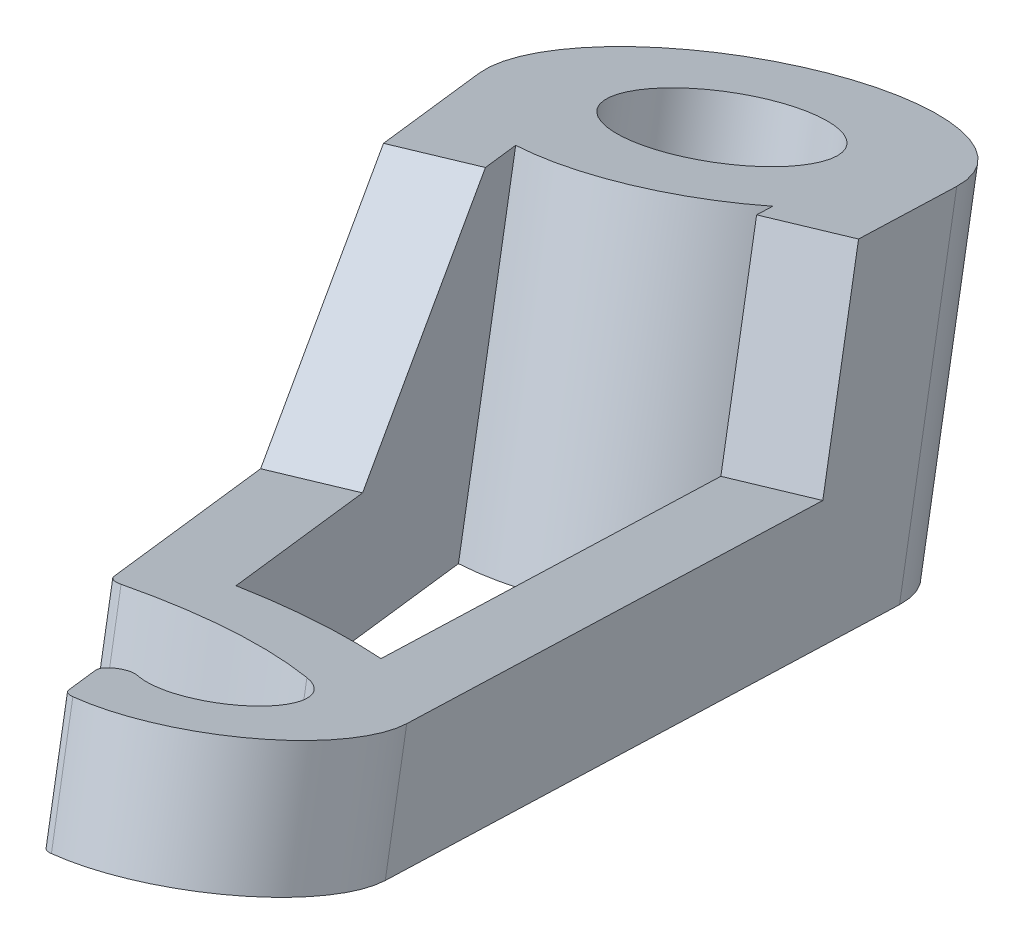
ISO-10303-21;
HEADER;
FILE_DESCRIPTION(('STEP AP214'),'2;1');
FILE_NAME('part.step','',(''),(''),'','','');
FILE_SCHEMA(('AUTOMOTIVE_DESIGN { 1 0 10303 214 1 1 1 1 }'));
ENDSEC;
DATA;
#1=APPLICATION_CONTEXT('core data for automotive mechanical design processes');
#2=APPLICATION_PROTOCOL_DEFINITION('international standard','automotive_design',2000,#1);
#3=PRODUCT_CONTEXT('',#1,'mechanical');
#4=PRODUCT('Part','Part','',(#3));
#5=PRODUCT_RELATED_PRODUCT_CATEGORY('part','',(#4));
#6=PRODUCT_DEFINITION_FORMATION('','',#4);
#7=PRODUCT_DEFINITION_CONTEXT('part definition',#1,'design');
#8=PRODUCT_DEFINITION('design','',#6,#7);
#9=PRODUCT_DEFINITION_SHAPE('','',#8);
#10=(LENGTH_UNIT() NAMED_UNIT(*) SI_UNIT(.MILLI.,.METRE.));
#11=(NAMED_UNIT(*) PLANE_ANGLE_UNIT() SI_UNIT($,.RADIAN.));
#12=(NAMED_UNIT(*) SI_UNIT($,.STERADIAN.) SOLID_ANGLE_UNIT());
#13=UNCERTAINTY_MEASURE_WITH_UNIT(LENGTH_MEASURE(1.E-05),#10,'distance_accuracy_value','');
#14=(GEOMETRIC_REPRESENTATION_CONTEXT(3) GLOBAL_UNCERTAINTY_ASSIGNED_CONTEXT((#13)) GLOBAL_UNIT_ASSIGNED_CONTEXT((#10,
#11,#12)) REPRESENTATION_CONTEXT('',''));
#15=CARTESIAN_POINT('',(0.,0.,0.));
#16=DIRECTION('',(0.,0.,1.));
#17=DIRECTION('',(1.,0.,0.));
#18=AXIS2_PLACEMENT_3D('',#15,#16,#17);
#19=CARTESIAN_POINT('',(-6.2463706120076,4.28236772923862,0.0966297651229249));
#20=DIRECTION('',(0.131884115621641,-0.93969262078591,0.31556989477326));
#21=DIRECTION('',(0.,-0.318350642704083,-0.947973031414869));
#22=AXIS2_PLACEMENT_3D('',#19,#20,#21);
#23=CYLINDRICAL_SURFACE('',#22,2.8300926820941);
#24=CARTESIAN_POINT('',(-6.08151546748055,3.10775195325624,0.4910921335895));
#25=DIRECTION('',(-0.131884115621641,0.93969262078591,-0.31556989477326));
#26=DIRECTION('',(0.,0.318350642704083,0.947973031414869));
#27=AXIS2_PLACEMENT_3D('',#24,#25,#26);
#28=CIRCLE('',#27,2.8300926820941);
#29=CARTESIAN_POINT('',(-4.92935117989364,2.43159707758848,-2.00385408381932));
#30=VERTEX_POINT('',#29);
#31=CARTESIAN_POINT('',(-6.29427963284796,2.1825502912952,-2.17502074546919));
#32=VERTEX_POINT('',#31);
#33=EDGE_CURVE('E197',#30,#32,#28,.T.);
#34=ORIENTED_EDGE('',*,*,#33,.T.);
#35=DIRECTION('',(0.131884115621641,-0.93969262078591,0.31556989477326));
#36=VECTOR('',#35,1.);
#37=CARTESIAN_POINT('',(-6.45913477737501,3.35716606727759,-2.56948311393577));
#38=LINE('',#37,#36);
#39=CARTESIAN_POINT('',(-6.19536654613173,1.47778082570577,-1.93834332438925));
#40=VERTEX_POINT('',#39);
#41=EDGE_CURVE('E285',#32,#40,#38,.T.);
#42=ORIENTED_EDGE('',*,*,#41,.T.);
#43=CARTESIAN_POINT('',(-5.98260238076432,2.4029824876668,0.727769554669445));
#44=DIRECTION('',(-0.131884115621641,0.93969262078591,-0.31556989477326));
#45=DIRECTION('',(0.,0.318350642704083,0.947973031414869));
#46=AXIS2_PLACEMENT_3D('',#43,#44,#45);
#47=CIRCLE('',#46,2.8300926820941);
#48=CARTESIAN_POINT('',(-4.83043809317741,1.72682761199905,-1.76717666273938));
#49=VERTEX_POINT('',#48);
#50=EDGE_CURVE('E256',#49,#40,#47,.T.);
#51=ORIENTED_EDGE('',*,*,#50,.F.);
#52=DIRECTION('',(0.131884115621641,-0.93969262078591,0.31556989477326));
#53=VECTOR('',#52,1.);
#54=CARTESIAN_POINT('',(-5.09420632442069,3.60621285357087,-2.3983164522859));
#55=LINE('',#54,#53);
#56=EDGE_CURVE('E264',#30,#49,#55,.T.);
#57=ORIENTED_EDGE('',*,*,#56,.F.);
#58=EDGE_LOOP('',(#34,#42,#51,#57));
#59=FACE_BOUND('',#58,.T.);
#60=ADVANCED_FACE('F37',(#59),#23,.F.);
#61=CARTESIAN_POINT('',(-5.26376823124328,3.7057213275453,-2.03113978954651));
#62=DIRECTION('',(0.131884115621641,-0.93969262078591,0.31556989477326));
#63=DIRECTION('',(0.,-0.318350642704083,-0.947973031414869));
#64=AXIS2_PLACEMENT_3D('',#61,#62,#63);
#65=CYLINDRICAL_SURFACE('',#64,0.416499553779431);
#66=DIRECTION('',(0.131884115621641,-0.93969262078591,0.31556989477326));
#67=VECTOR('',#66,1.);
#68=CARTESIAN_POINT('',(-5.43333013806587,3.80522980151974,-1.66396312680713));
#69=LINE('',#68,#67);
#70=CARTESIAN_POINT('',(-5.26847499353882,2.63061402553736,-1.26950075834056));
#71=VERTEX_POINT('',#70);
#72=CARTESIAN_POINT('',(-5.16956190682259,1.92584455994792,-1.03282333726061));
#73=VERTEX_POINT('',#72);
#74=EDGE_CURVE('E266',#71,#73,#69,.T.);
#75=ORIENTED_EDGE('',*,*,#74,.F.);
#76=CARTESIAN_POINT('',(-5.09891308671623,2.53110555156292,-1.63667742107994));
#77=DIRECTION('',(-0.131884115621641,0.93969262078591,-0.31556989477326));
#78=DIRECTION('',(0.,0.318350642704083,0.947973031414869));
#79=AXIS2_PLACEMENT_3D('',#76,#77,#78);
#80=CIRCLE('',#79,0.416499553779431);
#81=EDGE_CURVE('E352',#71,#30,#80,.T.);
#82=ORIENTED_EDGE('',*,*,#81,.T.);
#83=ORIENTED_EDGE('',*,*,#56,.T.);
#84=CARTESIAN_POINT('',(-5.,1.82633608597348,-1.39999999999999));
#85=DIRECTION('',(-0.131884115621641,0.93969262078591,-0.31556989477326));
#86=DIRECTION('',(0.,-0.318350642704083,-0.947973031414869));
#87=AXIS2_PLACEMENT_3D('',#84,#85,#86);
#88=CIRCLE('',#87,0.416499553779431);
#89=EDGE_CURVE('E253',#73,#49,#88,.T.);
#90=ORIENTED_EDGE('',*,*,#89,.F.);
#91=EDGE_LOOP('',(#75,#82,#83,#90));
#92=FACE_BOUND('',#91,.T.);
#93=ADVANCED_FACE('F367',(#92),#65,.F.);
#94=CARTESIAN_POINT('',(-5.43333013806587,3.80522980151974,-1.66396312680713));
#95=DIRECTION('',(0.407111857105102,-0.238916159864932,-0.881577565708106));
#96=DIRECTION('',(-0.907869279140984,0.,-0.419253350603224));
#97=AXIS2_PLACEMENT_3D('',#94,#95,#96);
#98=PLANE('',#97);
#99=DIRECTION('',(0.90380668057452,0.244738323512896,0.351050761504607));
#100=VECTOR('',#99,1.);
#101=CARTESIAN_POINT('',(-5.16956190682259,1.92584455994792,-1.03282333726061));
#102=LINE('',#101,#100);
#103=CARTESIAN_POINT('',(-5.20408425009461,1.9164963878247,-1.04623228317243));
#104=VERTEX_POINT('',#103);
#105=EDGE_CURVE('E251',#104,#73,#102,.T.);
#106=ORIENTED_EDGE('',*,*,#105,.F.);
#107=DIRECTION('',(0.131884115621641,-0.93969262078591,0.31556989477326));
#108=VECTOR('',#107,1.);
#109=CARTESIAN_POINT('',(-5.4678524813379,3.79588162939652,-1.67737207271895));
#110=LINE('',#109,#108);
#111=CARTESIAN_POINT('',(-5.30299733681085,2.62126585341413,-1.28290970425238));
#112=VERTEX_POINT('',#111);
#113=EDGE_CURVE('E12',#104,#112,#110,.F.);
#114=ORIENTED_EDGE('',*,*,#113,.T.);
#115=DIRECTION('',(0.90380668057452,0.244738323512896,0.351050761504607));
#116=VECTOR('',#115,1.);
#117=CARTESIAN_POINT('',(-5.26847499353882,2.63061402553736,-1.26950075834056));
#118=LINE('',#117,#116);
#119=EDGE_CURVE('E312',#112,#71,#118,.T.);
#120=ORIENTED_EDGE('',*,*,#119,.T.);
#121=ORIENTED_EDGE('',*,*,#74,.T.);
#122=EDGE_LOOP('',(#106,#114,#120,#121));
#123=FACE_BOUND('',#122,.T.);
#124=ADVANCED_FACE('F371',(#123),#98,.T.);
#125=CARTESIAN_POINT('',(-5.42002594293278,3.97343360751462,-1.16865205353568));
#126=DIRECTION('',(-0.905981049360744,0.0149187091184674,0.423055280450965));
#127=DIRECTION('',(0.42310236756999,0.,0.906081887335063));
#128=AXIS2_PLACEMENT_3D('',#125,#126,#127);
#129=PLANE('',#128);
#130=DIRECTION('',(-0.402249820690952,-0.341694615934679,-0.84937616589786));
#131=VECTOR('',#130,1.);
#132=CARTESIAN_POINT('',(-5.1562577116895,2.0940483659428,-0.537512263989163));
#133=LINE('',#132,#131);
#134=CARTESIAN_POINT('',(-5.17852533271077,2.07513294119613,-0.584531766780298));
#135=VERTEX_POINT('',#134);
#136=CARTESIAN_POINT('',(-5.3353935407412,1.94187987472304,-0.915768998556527));
#137=VERTEX_POINT('',#136);
#138=EDGE_CURVE('E248',#135,#137,#133,.T.);
#139=ORIENTED_EDGE('',*,*,#138,.F.);
#140=DIRECTION('',(0.131884115621641,-0.93969262078591,0.31556989477326));
#141=VECTOR('',#140,1.);
#142=CARTESIAN_POINT('',(-5.44229356395405,3.95451818276795,-1.21567155632682));
#143=LINE('',#142,#141);
#144=CARTESIAN_POINT('',(-5.277438419427,2.77990240678556,-0.821209187860243));
#145=VERTEX_POINT('',#144);
#146=EDGE_CURVE('E45',#135,#145,#143,.F.);
#147=ORIENTED_EDGE('',*,*,#146,.T.);
#148=DIRECTION('',(-0.402249820690952,-0.341694615934678,-0.84937616589786));
#149=VECTOR('',#148,1.);
#150=CARTESIAN_POINT('',(-5.25517079840573,2.79881783153223,-0.774189685069108));
#151=LINE('',#150,#149);
#152=CARTESIAN_POINT('',(-5.43430662745743,2.64664934031247,-1.15244641963647));
#153=VERTEX_POINT('',#152);
#154=EDGE_CURVE('E309',#145,#153,#151,.T.);
#155=ORIENTED_EDGE('',*,*,#154,.T.);
#156=DIRECTION('',(0.131884115621641,-0.93969262078591,0.31556989477326));
#157=VECTOR('',#156,1.);
#158=CARTESIAN_POINT('',(-5.59916177198448,3.82126511629486,-1.54690878810305));
#159=LINE('',#158,#157);
#160=EDGE_CURVE('E303',#153,#137,#159,.T.);
#161=ORIENTED_EDGE('',*,*,#160,.T.);
#162=EDGE_LOOP('',(#139,#147,#155,#161));
#163=FACE_BOUND('',#162,.T.);
#164=ADVANCED_FACE('F308',(#163),#129,.T.);
#165=CARTESIAN_POINT('',(-5.26376823124328,3.7057213275453,-2.03113978954651));
#166=DIRECTION('',(0.131884115621641,-0.93969262078591,0.31556989477326));
#167=DIRECTION('',(0.,-0.318350642704083,-0.947973031414869));
#168=AXIS2_PLACEMENT_3D('',#165,#166,#167);
#169=CYLINDRICAL_SURFACE('',#168,0.91649955377943);
#170=CARTESIAN_POINT('',(-5.09891308671623,2.53110555156292,-1.63667742107994));
#171=DIRECTION('',(-0.131884115621641,0.93969262078591,-0.31556989477326));
#172=DIRECTION('',(0.,0.318350642704083,0.947973031414869));
#173=AXIS2_PLACEMENT_3D('',#170,#171,#172);
#174=CIRCLE('',#173,0.91649955377943);
#175=CARTESIAN_POINT('',(-4.23961052888823,2.54477854181296,-1.9550853285285));
#176=VERTEX_POINT('',#175);
#177=CARTESIAN_POINT('',(-5.19760911740915,2.80869897671438,-0.768822354887411));
#178=VERTEX_POINT('',#177);
#179=EDGE_CURVE('E172',#176,#178,#174,.F.);
#180=ORIENTED_EDGE('',*,*,#179,.T.);
#181=DIRECTION('',(0.131884115621641,-0.93969262078591,0.31556989477326));
#182=VECTOR('',#181,1.);
#183=CARTESIAN_POINT('',(-5.3624642619362,3.98331475269677,-1.16328472335399));
#184=LINE('',#183,#182);
#185=CARTESIAN_POINT('',(-5.09869603069292,2.10392951112495,-0.532144933807466));
#186=VERTEX_POINT('',#185);
#187=EDGE_CURVE('E300',#178,#186,#184,.T.);
#188=ORIENTED_EDGE('',*,*,#187,.T.);
#189=CARTESIAN_POINT('',(-5.,1.82633608597348,-1.39999999999999));
#190=DIRECTION('',(0.131884115621641,-0.93969262078591,0.31556989477326));
#191=DIRECTION('',(0.,0.318350642704083,0.947973031414869));
#192=AXIS2_PLACEMENT_3D('',#189,#190,#191);
#193=CIRCLE('',#192,0.91649955377943);
#194=CARTESIAN_POINT('',(-4.140697442172,1.84000907622353,-1.71840790744856));
#195=VERTEX_POINT('',#194);
#196=EDGE_CURVE('E245',#195,#186,#193,.T.);
#197=ORIENTED_EDGE('',*,*,#196,.F.);
#198=DIRECTION('',(0.131884115621641,-0.93969262078591,0.31556989477326));
#199=VECTOR('',#198,1.);
#200=CARTESIAN_POINT('',(-4.40446567341528,3.71939431779535,-2.34954769699508));
#201=LINE('',#200,#199);
#202=EDGE_CURVE('E269',#176,#195,#201,.T.);
#203=ORIENTED_EDGE('',*,*,#202,.F.);
#204=EDGE_LOOP('',(#180,#188,#197,#203));
#205=FACE_BOUND('',#204,.T.);
#206=ADVANCED_FACE('F318',(#205),#169,.T.);
#207=CARTESIAN_POINT('',(-6.2463706120076,4.28236772923862,0.0966297651229249));
#208=DIRECTION('',(0.131884115621641,-0.93969262078591,0.31556989477326));
#209=DIRECTION('',(0.,-0.318350642704083,-0.947973031414869));
#210=AXIS2_PLACEMENT_3D('',#207,#208,#209);
#211=CYLINDRICAL_SURFACE('',#210,3.3300926820941);
#212=CARTESIAN_POINT('',(-6.08151546748055,3.10775195325624,0.4910921335895));
#213=DIRECTION('',(-0.131884115621641,0.93969262078591,-0.31556989477326));
#214=DIRECTION('',(0.,0.318350642704083,0.947973031414869));
#215=AXIS2_PLACEMENT_3D('',#212,#213,#214);
#216=CIRCLE('',#215,3.3300926820941);
#217=CARTESIAN_POINT('',(-4.9819336993829,2.24684352112363,-2.53203106570073));
#218=VERTEX_POINT('',#217);
#219=CARTESIAN_POINT('',(-6.04764977837671,2.05194188459175,-2.6670141795901));
#220=VERTEX_POINT('',#219);
#221=EDGE_CURVE('E185',#218,#220,#216,.T.);
#222=ORIENTED_EDGE('',*,*,#221,.F.);
#223=DIRECTION('',(0.131884115621641,-0.93969262078591,0.31556989477326));
#224=VECTOR('',#223,1.);
#225=CARTESIAN_POINT('',(-5.14678884390995,3.42145929710601,-2.92649343416731));
#226=LINE('',#225,#224);
#227=CARTESIAN_POINT('',(-4.88302061266667,1.54207405553419,-2.29535364462079));
#228=VERTEX_POINT('',#227);
#229=EDGE_CURVE('E222',#218,#228,#226,.T.);
#230=ORIENTED_EDGE('',*,*,#229,.T.);
#231=CARTESIAN_POINT('',(-5.98260238076432,2.4029824876668,0.727769554669445));
#232=DIRECTION('',(-0.131884115621641,0.93969262078591,-0.31556989477326));
#233=DIRECTION('',(0.,0.318350642704083,0.947973031414869));
#234=AXIS2_PLACEMENT_3D('',#231,#232,#233);
#235=CIRCLE('',#234,3.3300926820941);
#236=CARTESIAN_POINT('',(-5.94873669166048,1.34717241900232,-2.43033675851016));
#237=VERTEX_POINT('',#236);
#238=EDGE_CURVE('E212',#228,#237,#235,.T.);
#239=ORIENTED_EDGE('',*,*,#238,.T.);
#240=DIRECTION('',(0.131884115621641,-0.93969262078591,0.31556989477326));
#241=VECTOR('',#240,1.);
#242=CARTESIAN_POINT('',(-6.21250492290376,3.22655766057414,-3.06147654805668));
#243=LINE('',#242,#241);
#244=EDGE_CURVE('E220',#220,#237,#243,.T.);
#245=ORIENTED_EDGE('',*,*,#244,.F.);
#246=EDGE_LOOP('',(#222,#230,#239,#245));
#247=FACE_BOUND('',#246,.T.);
#248=ADVANCED_FACE('F404',(#247),#211,.T.);
#249=CARTESIAN_POINT('',(-7.39794712077145,1.69127416274271,-7.13776392256838));
#250=DIRECTION('',(0.131884115621641,-0.93969262078591,0.31556989477326));
#251=DIRECTION('',(0.,-0.318350642704083,-0.947973031414869));
#252=AXIS2_PLACEMENT_3D('',#249,#250,#251);
#253=CYLINDRICAL_SURFACE('',#252,1.17341117996063);
#254=CARTESIAN_POINT('',(-7.13417888952816,-0.188111078829114,-6.50662413302186));
#255=DIRECTION('',(0.131884115621641,-0.93969262078591,0.31556989477326));
#256=DIRECTION('',(0.,0.318350642704083,0.947973031414869));
#257=AXIS2_PLACEMENT_3D('',#254,#255,#256);
#258=CIRCLE('',#257,1.17341117996063);
#259=CARTESIAN_POINT('',(-8.19726718168052,-0.170605298758924,-6.01020633719932));
#260=VERTEX_POINT('',#259);
#261=CARTESIAN_POINT('',(-6.03399807201866,-0.170605298758921,-6.9142876139775));
#262=VERTEX_POINT('',#261);
#263=EDGE_CURVE('E229',#260,#262,#258,.T.);
#264=ORIENTED_EDGE('',*,*,#263,.F.);
#265=DIRECTION('',(0.131884115621641,-0.93969262078591,0.31556989477326));
#266=VECTOR('',#265,1.);
#267=CARTESIAN_POINT('',(-8.4610354129238,1.7087799428129,-6.64134612674584));
#268=LINE('',#267,#266);
#269=CARTESIAN_POINT('',(-8.4610354129238,1.7087799428129,-6.64134612674584));
#270=VERTEX_POINT('',#269);
#271=EDGE_CURVE('E260',#270,#260,#268,.T.);
#272=ORIENTED_EDGE('',*,*,#271,.F.);
#273=CARTESIAN_POINT('',(-7.39794712077145,1.69127416274271,-7.13776392256838));
#274=DIRECTION('',(0.131884115621641,-0.93969262078591,0.31556989477326));
#275=DIRECTION('',(0.,0.318350642704083,0.947973031414869));
#276=AXIS2_PLACEMENT_3D('',#273,#274,#275);
#277=CIRCLE('',#276,1.17341117996063);
#278=CARTESIAN_POINT('',(-6.29776630326194,1.7087799428129,-7.54542740352402));
#279=VERTEX_POINT('',#278);
#280=EDGE_CURVE('E232',#270,#279,#277,.T.);
#281=ORIENTED_EDGE('',*,*,#280,.T.);
#282=DIRECTION('',(0.131884115621641,-0.93969262078591,0.31556989477326));
#283=VECTOR('',#282,1.);
#284=CARTESIAN_POINT('',(-6.29776630326194,1.7087799428129,-7.54542740352402));
#285=LINE('',#284,#283);
#286=EDGE_CURVE('E239',#279,#262,#285,.T.);
#287=ORIENTED_EDGE('',*,*,#286,.T.);
#288=EDGE_LOOP('',(#264,#272,#281,#287));
#289=FACE_BOUND('',#288,.T.);
#290=ADVANCED_FACE('F329',(#289),#253,.T.);
#291=CARTESIAN_POINT('',(-8.4610354129238,1.7087799428129,-6.64134612674584));
#292=DIRECTION('',(-0.905981049360744,0.0149187091184675,0.423055280450965));
#293=DIRECTION('',(0.42310236756999,0.,0.906081887335063));
#294=AXIS2_PLACEMENT_3D('',#291,#292,#293);
#295=PLANE('',#294);
#296=DIRECTION('',(-0.402249820690953,-0.341694615934678,-0.84937616589786));
#297=VECTOR('',#296,1.);
#298=CARTESIAN_POINT('',(-8.19726718168052,-0.170605298758924,-6.01020633719932));
#299=LINE('',#298,#297);
#300=CARTESIAN_POINT('',(-6.29348257324447,1.44658112902993,-1.99024364677185));
#301=VERTEX_POINT('',#300);
#302=EDGE_CURVE('E235',#301,#260,#299,.T.);
#303=ORIENTED_EDGE('',*,*,#302,.F.);
#304=DIRECTION('',(0.131884115621641,-0.93969262078591,0.31556989477326));
#305=VECTOR('',#304,1.);
#306=CARTESIAN_POINT('',(-6.55725080448775,3.32596637060175,-2.62138343631837));
#307=LINE('',#306,#305);
#308=CARTESIAN_POINT('',(-6.3923956599607,2.15135059461936,-2.22692106785179));
#309=VERTEX_POINT('',#308);
#310=EDGE_CURVE('E294',#301,#309,#307,.F.);
#311=ORIENTED_EDGE('',*,*,#310,.T.);
#312=DIRECTION('',(-0.402249820690953,-0.341694615934678,-0.84937616589786));
#313=VECTOR('',#312,1.);
#314=CARTESIAN_POINT('',(-8.29618026839676,0.534164166830509,-6.24688375827926));
#315=LINE('',#314,#313);
#316=CARTESIAN_POINT('',(-7.24038476161121,1.43101886169889,-4.01750417027771));
#317=VERTEX_POINT('',#316);
#318=EDGE_CURVE('E193',#309,#317,#315,.T.);
#319=ORIENTED_EDGE('',*,*,#318,.T.);
#320=DIRECTION('',(-0.377780708199163,0.422416998636175,-0.823920879560498));
#321=VECTOR('',#320,1.);
#322=CARTESIAN_POINT('',(-8.00407379504532,2.28494078622588,-5.68307185671981));
#323=LINE('',#322,#321);
#324=CARTESIAN_POINT('',(-7.9085312037971,2.1781094585242,-5.47469823120576));
#325=VERTEX_POINT('',#324);
#326=EDGE_CURVE('E282',#317,#325,#323,.T.);
#327=ORIENTED_EDGE('',*,*,#326,.T.);
#328=DIRECTION('',(-0.402249820690953,-0.341694615934678,-0.84937616589786));
#329=VECTOR('',#328,1.);
#330=CARTESIAN_POINT('',(-8.4610354129238,1.7087799428129,-6.64134612674584));
#331=LINE('',#330,#329);
#332=EDGE_CURVE('E237',#325,#270,#331,.T.);
#333=ORIENTED_EDGE('',*,*,#332,.T.);
#334=ORIENTED_EDGE('',*,*,#271,.T.);
#335=EDGE_LOOP('',(#303,#311,#319,#327,#333,#334));
#336=FACE_BOUND('',#335,.T.);
#337=ADVANCED_FACE('F332',(#336),#295,.T.);
#338=CARTESIAN_POINT('',(-4.40446567341528,3.71939431779535,-2.34954769699508));
#339=DIRECTION('',(0.937591899837199,0.0149187091184697,-0.347417416773988));
#340=DIRECTION('',(-0.347456085208141,0.,-0.937696256178851));
#341=AXIS2_PLACEMENT_3D('',#338,#339,#340);
#342=PLANE('',#341);
#343=DIRECTION('',(-0.131884115621641,0.93969262078591,-0.315569894773261));
#344=VECTOR('',#343,1.);
#345=CARTESIAN_POINT('',(-5.93633691205236,2.09260442269277,-6.55353863027565));
#346=LINE('',#345,#344);
#347=CARTESIAN_POINT('',(-5.77148176752531,0.917988646710389,-6.15907626180908));
#348=VERTEX_POINT('',#347);
#349=CARTESIAN_POINT('',(-5.93633691205236,2.09260442269278,-6.55353863027565));
#350=VERTEX_POINT('',#349);
#351=EDGE_CURVE('E180',#348,#350,#346,.T.);
#352=ORIENTED_EDGE('',*,*,#351,.F.);
#353=DIRECTION('',(0.321757687408351,0.341694615934678,0.883015730343963));
#354=VECTOR('',#353,1.);
#355=CARTESIAN_POINT('',(-4.23961052888823,2.54477854181296,-1.9550853285285));
#356=LINE('',#355,#354);
#357=EDGE_CURVE('E166',#348,#176,#356,.T.);
#358=ORIENTED_EDGE('',*,*,#357,.T.);
#359=ORIENTED_EDGE('',*,*,#202,.T.);
#360=DIRECTION('',(0.321757687408351,0.341694615934678,0.883015730343963));
#361=VECTOR('',#360,1.);
#362=CARTESIAN_POINT('',(-4.140697442172,1.84000907622353,-1.71840790744856));
#363=LINE('',#362,#361);
#364=EDGE_CURVE('E242',#262,#195,#363,.T.);
#365=ORIENTED_EDGE('',*,*,#364,.F.);
#366=ORIENTED_EDGE('',*,*,#286,.F.);
#367=DIRECTION('',(0.321757687408351,0.341694615934678,0.883015730343963));
#368=VECTOR('',#367,1.);
#369=CARTESIAN_POINT('',(-4.40446567341528,3.71939431779535,-2.34954769699508));
#370=LINE('',#369,#368);
#371=EDGE_CURVE('E191',#279,#350,#370,.T.);
#372=ORIENTED_EDGE('',*,*,#371,.T.);
#373=EDGE_LOOP('',(#352,#358,#359,#365,#366,#372));
#374=FACE_BOUND('',#373,.T.);
#375=ADVANCED_FACE('F189',(#374),#342,.T.);
#376=CARTESIAN_POINT('',(-7.39794712077145,1.69127416274271,-7.13776392256838));
#377=DIRECTION('',(-0.131884115621641,0.93969262078591,-0.31556989477326));
#378=DIRECTION('',(0.,0.318350642704083,0.947973031414869));
#379=AXIS2_PLACEMENT_3D('',#376,#377,#378);
#380=PLANE('',#379);
#381=DIRECTION('',(-0.922664646897069,0.,0.385603357566174));
#382=VECTOR('',#381,1.);
#383=CARTESIAN_POINT('',(-4.9947527034833,2.09260442269278,-6.94704891971456));
#384=LINE('',#383,#382);
#385=CARTESIAN_POINT('',(-6.39810873996081,2.09260442269278,-6.36055327219372));
#386=VERTEX_POINT('',#385);
#387=EDGE_CURVE('E186',#350,#386,#384,.T.);
#388=ORIENTED_EDGE('',*,*,#387,.F.);
#389=ORIENTED_EDGE('',*,*,#371,.F.);
#390=ORIENTED_EDGE('',*,*,#280,.F.);
#391=ORIENTED_EDGE('',*,*,#332,.F.);
#392=DIRECTION('',(0.922664646897069,0.,-0.385603357566174));
#393=VECTOR('',#392,1.);
#394=CARTESIAN_POINT('',(-4.90416554606949,2.1781094585242,-6.73029362967724));
#395=LINE('',#394,#393);
#396=CARTESIAN_POINT('',(-7.44675937588866,2.1781094585242,-5.66768358928769));
#397=VERTEX_POINT('',#396);
#398=EDGE_CURVE('E277',#325,#397,#395,.T.);
#399=ORIENTED_EDGE('',*,*,#398,.T.);
#400=DIRECTION('',(-0.402249820690954,-0.341694615934678,-0.84937616589786));
#401=VECTOR('',#400,1.);
#402=CARTESIAN_POINT('',(-6.21250492290376,3.22655766057414,-3.06147654805669));
#403=LINE('',#402,#401);
#404=CARTESIAN_POINT('',(-7.62150579516114,2.02966958969665,-6.03667180499675));
#405=VERTEX_POINT('',#404);
#406=EDGE_CURVE('E207',#397,#405,#403,.T.);
#407=ORIENTED_EDGE('',*,*,#406,.T.);
#408=CARTESIAN_POINT('',(-7.39794712077145,1.69127416274271,-7.13776392256838));
#409=DIRECTION('',(-0.131884115621641,0.93969262078591,-0.31556989477326));
#410=DIRECTION('',(0.,0.318350642704083,0.947973031414869));
#411=AXIS2_PLACEMENT_3D('',#408,#409,#410);
#412=CIRCLE('',#411,1.17341117996063);
#413=CARTESIAN_POINT('',(-6.45737150085294,2.02966958969665,-6.52319103389839));
#414=VERTEX_POINT('',#413);
#415=EDGE_CURVE('E201',#405,#414,#412,.T.);
#416=ORIENTED_EDGE('',*,*,#415,.T.);
#417=DIRECTION('',(0.321757687408351,0.341694615934678,0.883015730343963));
#418=VECTOR('',#417,1.);
#419=CARTESIAN_POINT('',(-6.45737150085294,2.02966958969665,-6.52319103389839));
#420=LINE('',#419,#418);
#421=EDGE_CURVE('E203',#414,#386,#420,.T.);
#422=ORIENTED_EDGE('',*,*,#421,.T.);
#423=EDGE_LOOP('',(#388,#389,#390,#391,#399,#407,#416,#422));
#424=FACE_BOUND('',#423,.T.);
#425=CARTESIAN_POINT('',(-7.39794712077145,1.69127416274271,-7.13776392256838));
#426=DIRECTION('',(0.131884115621641,-0.93969262078591,0.31556989477326));
#427=DIRECTION('',(0.,-0.318350642704083,-0.947973031414869));
#428=AXIS2_PLACEMENT_3D('',#425,#426,#427);
#429=CIRCLE('',#428,0.573411179960617);
#430=CARTESIAN_POINT('',(-7.39794712077145,1.50872834506854,-7.68134225708283));
#431=VERTEX_POINT('',#430);
#432=EDGE_CURVE('E226',#431,#431,#429,.T.);
#433=ORIENTED_EDGE('',*,*,#432,.T.);
#434=EDGE_LOOP('',(#433));
#435=FACE_BOUND('',#434,.T.);
#436=ADVANCED_FACE('F326',(#424,#435),#380,.T.);
#437=CARTESIAN_POINT('',(-7.13417888952816,-0.188111078829114,-6.50662413302186));
#438=DIRECTION('',(-0.131884115621641,0.93969262078591,-0.31556989477326));
#439=DIRECTION('',(0.,0.318350642704083,0.947973031414869));
#440=AXIS2_PLACEMENT_3D('',#437,#438,#439);
#441=PLANE('',#440);
#442=DIRECTION('',(0.321757687408351,0.341694615934678,0.883015730343963));
#443=VECTOR('',#442,1.);
#444=CARTESIAN_POINT('',(-6.19360326960966,0.150284348124828,-5.89205124435187));
#445=LINE('',#444,#443);
#446=CARTESIAN_POINT('',(-6.19360326960966,0.150284348124828,-5.89205124435187));
#447=VERTEX_POINT('',#446);
#448=EDGE_CURVE('E195',#447,#228,#445,.T.);
#449=ORIENTED_EDGE('',*,*,#448,.F.);
#450=CARTESIAN_POINT('',(-7.13417888952816,-0.188111078829114,-6.50662413302186));
#451=DIRECTION('',(-0.131884115621641,0.93969262078591,-0.31556989477326));
#452=DIRECTION('',(0.,0.318350642704083,0.947973031414869));
#453=AXIS2_PLACEMENT_3D('',#450,#451,#452);
#454=CIRCLE('',#453,1.17341117996063);
#455=CARTESIAN_POINT('',(-7.35773756391786,0.150284348124826,-5.40553201545023));
#456=VERTEX_POINT('',#455);
#457=EDGE_CURVE('E192',#456,#447,#454,.T.);
#458=ORIENTED_EDGE('',*,*,#457,.F.);
#459=DIRECTION('',(-0.402249820690954,-0.341694615934678,-0.84937616589786));
#460=VECTOR('',#459,1.);
#461=CARTESIAN_POINT('',(-5.94873669166048,1.34717241900232,-2.43033675851017));
#462=LINE('',#461,#460);
#463=EDGE_CURVE('E204',#237,#456,#462,.T.);
#464=ORIENTED_EDGE('',*,*,#463,.F.);
#465=ORIENTED_EDGE('',*,*,#238,.F.);
#466=EDGE_LOOP('',(#449,#458,#464,#465));
#467=FACE_BOUND('',#466,.T.);
#468=CARTESIAN_POINT('',(-7.13417888952816,-0.188111078829114,-6.50662413302186));
#469=DIRECTION('',(0.131884115621641,-0.93969262078591,0.31556989477326));
#470=DIRECTION('',(0.,-0.318350642704083,-0.947973031414869));
#471=AXIS2_PLACEMENT_3D('',#468,#469,#470);
#472=CIRCLE('',#471,0.573411179960617);
#473=CARTESIAN_POINT('',(-7.13417888952816,-0.370656896503283,-7.05020246753631));
#474=VERTEX_POINT('',#473);
#475=EDGE_CURVE('E219',#474,#474,#472,.T.);
#476=ORIENTED_EDGE('',*,*,#475,.F.);
#477=EDGE_LOOP('',(#476));
#478=FACE_BOUND('',#477,.T.);
#479=ORIENTED_EDGE('',*,*,#50,.T.);
#480=CARTESIAN_POINT('',(-6.2028844683084,1.44508925811808,-2.03254917481694));
#481=DIRECTION('',(-0.131884115621641,0.93969262078591,-0.31556989477326));
#482=DIRECTION('',(0.,0.318350642704083,0.947973031414869));
#483=AXIS2_PLACEMENT_3D('',#480,#481,#482);
#484=CIRCLE('',#483,0.1);
#485=EDGE_CURVE('E292',#40,#301,#484,.F.);
#486=ORIENTED_EDGE('',*,*,#485,.T.);
#487=ORIENTED_EDGE('',*,*,#302,.T.);
#488=ORIENTED_EDGE('',*,*,#263,.T.);
#489=ORIENTED_EDGE('',*,*,#364,.T.);
#490=ORIENTED_EDGE('',*,*,#196,.T.);
#491=CARTESIAN_POINT('',(-5.08792722777469,2.07364107028428,-0.626837294825394));
#492=DIRECTION('',(-0.131884115621641,0.93969262078591,-0.31556989477326));
#493=DIRECTION('',(0.,0.318350642704083,0.947973031414869));
#494=AXIS2_PLACEMENT_3D('',#491,#492,#493);
#495=CIRCLE('',#494,0.1);
#496=EDGE_CURVE('E290',#186,#135,#495,.F.);
#497=ORIENTED_EDGE('',*,*,#496,.T.);
#498=ORIENTED_EDGE('',*,*,#138,.T.);
#499=CARTESIAN_POINT('',(-5.24479543580512,1.94038800381119,-0.958074526601623));
#500=DIRECTION('',(-0.131884115621641,0.93969262078591,-0.31556989477326));
#501=DIRECTION('',(0.,0.318350642704083,0.947973031414869));
#502=AXIS2_PLACEMENT_3D('',#499,#500,#501);
#503=CIRCLE('',#502,0.1);
#504=EDGE_CURVE('E288',#137,#104,#503,.F.);
#505=ORIENTED_EDGE('',*,*,#504,.T.);
#506=ORIENTED_EDGE('',*,*,#105,.T.);
#507=ORIENTED_EDGE('',*,*,#89,.T.);
#508=EDGE_LOOP('',(#479,#486,#487,#488,#489,#490,#497,#498,#505,#506,#507));
#509=FACE_BOUND('',#508,.T.);
#510=ADVANCED_FACE('F320',(#467,#478,#509),#441,.F.);
#511=CARTESIAN_POINT('',(-7.39794712077145,1.69127416274271,-7.13776392256838));
#512=DIRECTION('',(0.131884115621641,-0.93969262078591,0.31556989477326));
#513=DIRECTION('',(0.,-0.318350642704083,-0.947973031414869));
#514=AXIS2_PLACEMENT_3D('',#511,#512,#513);
#515=CYLINDRICAL_SURFACE('',#514,0.573411179960617);
#516=ORIENTED_EDGE('',*,*,#432,.F.);
#517=EDGE_LOOP('',(#516));
#518=FACE_BOUND('',#517,.T.);
#519=ORIENTED_EDGE('',*,*,#475,.T.);
#520=EDGE_LOOP('',(#519));
#521=FACE_BOUND('',#520,.T.);
#522=ADVANCED_FACE('F389',(#518,#521),#515,.F.);
#523=CARTESIAN_POINT('',(-7.39794712077145,1.69127416274271,-7.13776392256838));
#524=DIRECTION('',(0.131884115621641,-0.93969262078591,0.31556989477326));
#525=DIRECTION('',(0.,-0.318350642704083,-0.947973031414869));
#526=AXIS2_PLACEMENT_3D('',#523,#524,#525);
#527=CYLINDRICAL_SURFACE('',#526,1.17341117996063);
#528=ORIENTED_EDGE('',*,*,#457,.T.);
#529=DIRECTION('',(0.131884115621641,-0.93969262078591,0.31556989477326));
#530=VECTOR('',#529,1.);
#531=CARTESIAN_POINT('',(-6.45737150085294,2.02966958969665,-6.52319103389839));
#532=LINE('',#531,#530);
#533=EDGE_CURVE('E208',#414,#447,#532,.T.);
#534=ORIENTED_EDGE('',*,*,#533,.F.);
#535=ORIENTED_EDGE('',*,*,#415,.F.);
#536=DIRECTION('',(0.131884115621641,-0.93969262078591,0.31556989477326));
#537=VECTOR('',#536,1.);
#538=CARTESIAN_POINT('',(-7.62150579516114,2.02966958969665,-6.03667180499675));
#539=LINE('',#538,#537);
#540=EDGE_CURVE('E217',#405,#456,#539,.T.);
#541=ORIENTED_EDGE('',*,*,#540,.T.);
#542=EDGE_LOOP('',(#528,#534,#535,#541));
#543=FACE_BOUND('',#542,.T.);
#544=ADVANCED_FACE('F395',(#543),#527,.T.);
#545=CARTESIAN_POINT('',(-6.21250492290376,3.22655766057414,-3.06147654805669));
#546=DIRECTION('',(-0.905981049360743,0.0149187091184678,0.423055280450966));
#547=DIRECTION('',(0.423102367569991,0.,0.906081887335062));
#548=AXIS2_PLACEMENT_3D('',#545,#546,#547);
#549=PLANE('',#548);
#550=ORIENTED_EDGE('',*,*,#406,.F.);
#551=DIRECTION('',(0.377780708199164,-0.422416998636175,0.823920879560498));
#552=VECTOR('',#551,1.);
#553=CARTESIAN_POINT('',(-6.62670944152886,1.26116736887828,-3.87919558940535));
#554=LINE('',#553,#552);
#555=CARTESIAN_POINT('',(-6.77861293370277,1.43101886169889,-4.21048952835964));
#556=VERTEX_POINT('',#555);
#557=EDGE_CURVE('E280',#397,#556,#554,.T.);
#558=ORIENTED_EDGE('',*,*,#557,.T.);
#559=DIRECTION('',(-0.402249820690954,-0.341694615934678,-0.84937616589786));
#560=VECTOR('',#559,1.);
#561=CARTESIAN_POINT('',(-6.04764977837671,2.05194188459175,-2.66701417959011));
#562=LINE('',#561,#560);
#563=EDGE_CURVE('E176',#220,#556,#562,.T.);
#564=ORIENTED_EDGE('',*,*,#563,.F.);
#565=ORIENTED_EDGE('',*,*,#244,.T.);
#566=ORIENTED_EDGE('',*,*,#463,.T.);
#567=ORIENTED_EDGE('',*,*,#540,.F.);
#568=EDGE_LOOP('',(#550,#558,#564,#565,#566,#567));
#569=FACE_BOUND('',#568,.T.);
#570=ADVANCED_FACE('F344',(#569),#549,.F.);
#571=CARTESIAN_POINT('',(-6.45737150085294,2.02966958969665,-6.52319103389839));
#572=DIRECTION('',(0.937591899837199,0.0149187091184699,-0.347417416773988));
#573=DIRECTION('',(-0.34745608520814,0.,-0.937696256178851));
#574=AXIS2_PLACEMENT_3D('',#571,#572,#573);
#575=PLANE('',#574);
#576=DIRECTION('',(0.321757687408351,0.341694615934678,0.883015730343963));
#577=VECTOR('',#576,1.);
#578=CARTESIAN_POINT('',(-6.29251635632589,0.85505381371426,-6.12872866543182));
#579=LINE('',#578,#577);
#580=CARTESIAN_POINT('',(-6.23325359543375,0.91798864671039,-5.96609090372715));
#581=VERTEX_POINT('',#580);
#582=EDGE_CURVE('E263',#581,#218,#579,.T.);
#583=ORIENTED_EDGE('',*,*,#582,.F.);
#584=DIRECTION('',(-0.131884115621641,0.93969262078591,-0.315569894773261));
#585=VECTOR('',#584,1.);
#586=CARTESIAN_POINT('',(-6.39810873996081,2.09260442269278,-6.36055327219372));
#587=LINE('',#586,#585);
#588=EDGE_CURVE('E183',#581,#386,#587,.T.);
#589=ORIENTED_EDGE('',*,*,#588,.T.);
#590=ORIENTED_EDGE('',*,*,#421,.F.);
#591=ORIENTED_EDGE('',*,*,#533,.T.);
#592=ORIENTED_EDGE('',*,*,#448,.T.);
#593=ORIENTED_EDGE('',*,*,#229,.F.);
#594=EDGE_LOOP('',(#583,#589,#590,#591,#592,#593));
#595=FACE_BOUND('',#594,.T.);
#596=ADVANCED_FACE('F400',(#595),#575,.F.);
#597=CARTESIAN_POINT('',(-3.47717558382932,-8.72034309635163,-3.31581820097186));
#598=DIRECTION('',(-0.362348629655204,-0.342020143325666,-0.867021160149213));
#599=DIRECTION('',(-0.922664646897069,0.,0.385603357566174));
#600=AXIS2_PLACEMENT_3D('',#597,#598,#599);
#601=PLANE('',#600);
#602=ORIENTED_EDGE('',*,*,#351,.T.);
#603=ORIENTED_EDGE('',*,*,#387,.T.);
#604=ORIENTED_EDGE('',*,*,#588,.F.);
#605=DIRECTION('',(0.922664646897069,0.,-0.385603357566174));
#606=VECTOR('',#605,1.);
#607=CARTESIAN_POINT('',(-4.82989755895625,0.91798864671039,-6.55258655124799));
#608=LINE('',#607,#606);
#609=EDGE_CURVE('E170',#581,#348,#608,.T.);
#610=ORIENTED_EDGE('',*,*,#609,.T.);
#611=EDGE_LOOP('',(#602,#603,#604,#610));
#612=FACE_BOUND('',#611,.T.);
#613=ADVANCED_FACE('F179',(#612),#601,.F.);
#614=CARTESIAN_POINT('',(-7.23309197624439,0.516658386760318,-6.74330155410181));
#615=DIRECTION('',(-0.131884115621641,0.93969262078591,-0.31556989477326));
#616=DIRECTION('',(0.,0.318350642704083,0.947973031414869));
#617=AXIS2_PLACEMENT_3D('',#614,#615,#616);
#618=PLANE('',#617);
#619=ORIENTED_EDGE('',*,*,#318,.F.);
#620=CARTESIAN_POINT('',(-6.30179755502463,2.14985872370751,-2.26922659589689));
#621=DIRECTION('',(-0.131884115621641,0.93969262078591,-0.31556989477326));
#622=DIRECTION('',(0.,0.318350642704083,0.947973031414869));
#623=AXIS2_PLACEMENT_3D('',#620,#621,#622);
#624=CIRCLE('',#623,0.1);
#625=EDGE_CURVE('E298',#309,#32,#624,.T.);
#626=ORIENTED_EDGE('',*,*,#625,.T.);
#627=ORIENTED_EDGE('',*,*,#33,.F.);
#628=ORIENTED_EDGE('',*,*,#81,.F.);
#629=ORIENTED_EDGE('',*,*,#119,.F.);
#630=CARTESIAN_POINT('',(-5.34370852252136,2.64515746940062,-1.19475194768157));
#631=DIRECTION('',(-0.131884115621641,0.93969262078591,-0.31556989477326));
#632=DIRECTION('',(0.,0.318350642704083,0.947973031414869));
#633=AXIS2_PLACEMENT_3D('',#630,#631,#632);
#634=CIRCLE('',#633,0.1);
#635=EDGE_CURVE('E58',#112,#153,#634,.T.);
#636=ORIENTED_EDGE('',*,*,#635,.T.);
#637=ORIENTED_EDGE('',*,*,#154,.F.);
#638=CARTESIAN_POINT('',(-5.18684031449092,2.77841053587371,-0.86351471590534));
#639=DIRECTION('',(-0.131884115621641,0.93969262078591,-0.31556989477326));
#640=DIRECTION('',(0.,0.318350642704083,0.947973031414869));
#641=AXIS2_PLACEMENT_3D('',#638,#639,#640);
#642=CIRCLE('',#641,0.1);
#643=EDGE_CURVE('E52',#145,#178,#642,.T.);
#644=ORIENTED_EDGE('',*,*,#643,.T.);
#645=ORIENTED_EDGE('',*,*,#179,.F.);
#646=ORIENTED_EDGE('',*,*,#357,.F.);
#647=ORIENTED_EDGE('',*,*,#609,.F.);
#648=ORIENTED_EDGE('',*,*,#582,.T.);
#649=ORIENTED_EDGE('',*,*,#221,.T.);
#650=ORIENTED_EDGE('',*,*,#563,.T.);
#651=DIRECTION('',(-0.922664646897069,0.,0.385603357566174));
#652=VECTOR('',#651,1.);
#653=CARTESIAN_POINT('',(-6.26438509868075,1.43101886169889,-4.42539749129646));
#654=LINE('',#653,#652);
#655=EDGE_CURVE('E274',#556,#317,#654,.T.);
#656=ORIENTED_EDGE('',*,*,#655,.T.);
#657=EDGE_LOOP('',(#619,#626,#627,#628,#629,#636,#637,#644,#645,#646,#647,#648,#649,#650,#656));
#658=FACE_BOUND('',#657,.T.);
#659=ADVANCED_FACE('F169',(#658),#618,.T.);
#660=CARTESIAN_POINT('',(-5.02772373238871,2.32752757788928,-7.02594139340789));
#661=DIRECTION('',(-0.162963020695997,-0.906307787036646,-0.389934929241243));
#662=DIRECTION('',(0.922664646897069,0.,-0.385603357566174));
#663=AXIS2_PLACEMENT_3D('',#660,#661,#662);
#664=PLANE('',#663);
#665=ORIENTED_EDGE('',*,*,#326,.F.);
#666=ORIENTED_EDGE('',*,*,#655,.F.);
#667=ORIENTED_EDGE('',*,*,#557,.F.);
#668=ORIENTED_EDGE('',*,*,#398,.F.);
#669=EDGE_LOOP('',(#665,#666,#667,#668));
#670=FACE_BOUND('',#669,.T.);
#671=ADVANCED_FACE('F340',(#670),#664,.F.);
#672=CARTESIAN_POINT('',(-6.46665269955168,3.3244744996899,-2.66368896436346));
#673=DIRECTION('',(0.131884115621641,-0.93969262078591,0.31556989477326));
#674=DIRECTION('',(0.,-0.318350642704083,-0.947973031414869));
#675=AXIS2_PLACEMENT_3D('',#672,#673,#674);
#676=CYLINDRICAL_SURFACE('',#675,0.1);
#677=ORIENTED_EDGE('',*,*,#625,.F.);
#678=ORIENTED_EDGE('',*,*,#310,.F.);
#679=ORIENTED_EDGE('',*,*,#485,.F.);
#680=ORIENTED_EDGE('',*,*,#41,.F.);
#681=EDGE_LOOP('',(#677,#678,#679,#680));
#682=FACE_BOUND('',#681,.T.);
#683=ADVANCED_FACE('F362',(#682),#676,.T.);
#684=CARTESIAN_POINT('',(-5.35169545901798,3.9530263118561,-1.25797708437191));
#685=DIRECTION('',(0.131884115621641,-0.93969262078591,0.31556989477326));
#686=DIRECTION('',(0.,-0.318350642704083,-0.947973031414869));
#687=AXIS2_PLACEMENT_3D('',#684,#685,#686);
#688=CYLINDRICAL_SURFACE('',#687,0.1);
#689=ORIENTED_EDGE('',*,*,#643,.F.);
#690=ORIENTED_EDGE('',*,*,#146,.F.);
#691=ORIENTED_EDGE('',*,*,#496,.F.);
#692=ORIENTED_EDGE('',*,*,#187,.F.);
#693=EDGE_LOOP('',(#689,#690,#691,#692));
#694=FACE_BOUND('',#693,.T.);
#695=ADVANCED_FACE('F315',(#694),#688,.T.);
#696=CARTESIAN_POINT('',(-5.50856366704841,3.81977324538301,-1.58921431614814));
#697=DIRECTION('',(0.131884115621641,-0.93969262078591,0.31556989477326));
#698=DIRECTION('',(0.,-0.318350642704083,-0.947973031414869));
#699=AXIS2_PLACEMENT_3D('',#696,#697,#698);
#700=CYLINDRICAL_SURFACE('',#699,0.1);
#701=ORIENTED_EDGE('',*,*,#635,.F.);
#702=ORIENTED_EDGE('',*,*,#113,.F.);
#703=ORIENTED_EDGE('',*,*,#504,.F.);
#704=ORIENTED_EDGE('',*,*,#160,.F.);
#705=EDGE_LOOP('',(#701,#702,#703,#704));
#706=FACE_BOUND('',#705,.T.);
#707=ADVANCED_FACE('F39',(#706),#700,.T.);
#708=CLOSED_SHELL('',(#60,#93,#124,#164,#206,#248,#290,#337,#375,#436,#510,#522,#544,#570,#596,
#613,#659,#671,#683,#695,#707));
#709=MANIFOLD_SOLID_BREP('B2',#708);
#710=ADVANCED_BREP_SHAPE_REPRESENTATION('',(#18,#709),#14);
#711=SHAPE_DEFINITION_REPRESENTATION(#9,#710);
ENDSEC;
END-ISO-10303-21;
